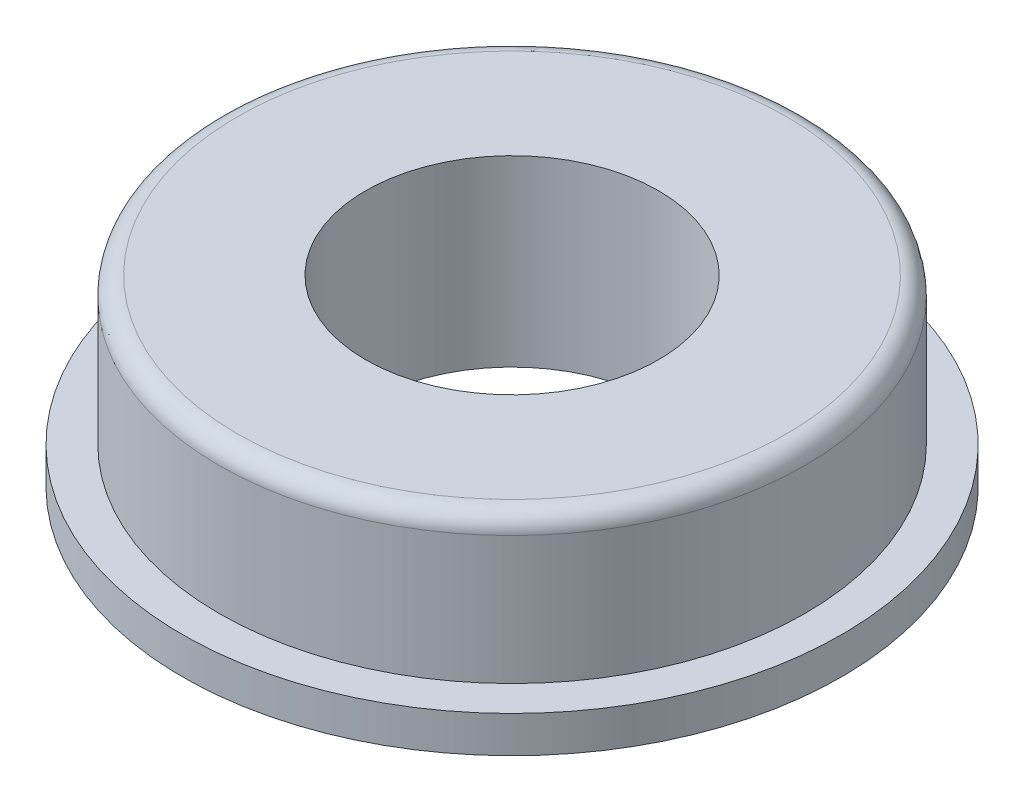
ISO-10303-21;
HEADER;
FILE_DESCRIPTION(('STEP AP214'),'2;1');
FILE_NAME('part.step','',(''),(''),'','','');
FILE_SCHEMA(('AUTOMOTIVE_DESIGN { 1 0 10303 214 1 1 1 1 }'));
ENDSEC;
DATA;
#1=APPLICATION_CONTEXT('core data for automotive mechanical design processes');
#2=APPLICATION_PROTOCOL_DEFINITION('international standard','automotive_design',2000,#1);
#3=PRODUCT_CONTEXT('',#1,'mechanical');
#4=PRODUCT('Part','Part','',(#3));
#5=PRODUCT_RELATED_PRODUCT_CATEGORY('part','',(#4));
#6=PRODUCT_DEFINITION_FORMATION('','',#4);
#7=PRODUCT_DEFINITION_CONTEXT('part definition',#1,'design');
#8=PRODUCT_DEFINITION('design','',#6,#7);
#9=PRODUCT_DEFINITION_SHAPE('','',#8);
#10=(LENGTH_UNIT() NAMED_UNIT(*) SI_UNIT(.MILLI.,.METRE.));
#11=(NAMED_UNIT(*) PLANE_ANGLE_UNIT() SI_UNIT($,.RADIAN.));
#12=(NAMED_UNIT(*) SI_UNIT($,.STERADIAN.) SOLID_ANGLE_UNIT());
#13=UNCERTAINTY_MEASURE_WITH_UNIT(LENGTH_MEASURE(1.E-05),#10,'distance_accuracy_value','');
#14=(GEOMETRIC_REPRESENTATION_CONTEXT(3) GLOBAL_UNCERTAINTY_ASSIGNED_CONTEXT((#13)) GLOBAL_UNIT_ASSIGNED_CONTEXT((#10,
#11,#12)) REPRESENTATION_CONTEXT('',''));
#15=CARTESIAN_POINT('',(0.,0.,0.));
#16=DIRECTION('',(0.,0.,1.));
#17=DIRECTION('',(1.,0.,0.));
#18=AXIS2_PLACEMENT_3D('',#15,#16,#17);
#19=CARTESIAN_POINT('',(0.,4.5,0.));
#20=DIRECTION('',(0.,1.,0.));
#21=DIRECTION('',(0.,0.,1.));
#22=AXIS2_PLACEMENT_3D('',#19,#20,#21);
#23=TOROIDAL_SURFACE('',#22,7.5,0.5);
#24=CARTESIAN_POINT('',(0.,4.5,0.));
#25=DIRECTION('',(0.,-1.,0.));
#26=DIRECTION('',(0.,0.,-1.));
#27=AXIS2_PLACEMENT_3D('',#24,#25,#26);
#28=CIRCLE('',#27,8.);
#29=CARTESIAN_POINT('',(0.,4.5,-8.));
#30=VERTEX_POINT('',#29);
#31=EDGE_CURVE('E45',#30,#30,#28,.T.);
#32=ORIENTED_EDGE('',*,*,#31,.F.);
#33=EDGE_LOOP('',(#32));
#34=FACE_BOUND('',#33,.T.);
#35=CARTESIAN_POINT('',(0.,5.,0.));
#36=DIRECTION('',(0.,-1.,0.));
#37=DIRECTION('',(0.,0.,1.));
#38=AXIS2_PLACEMENT_3D('',#35,#36,#37);
#39=CIRCLE('',#38,7.5);
#40=CARTESIAN_POINT('',(0.,5.,-7.5));
#41=VERTEX_POINT('',#40);
#42=CARTESIAN_POINT('',(0.,5.,7.5));
#43=VERTEX_POINT('',#42);
#44=EDGE_CURVE('E37',#41,#43,#39,.F.);
#45=ORIENTED_EDGE('',*,*,#44,.F.);
#46=CARTESIAN_POINT('',(0.,5.,0.));
#47=DIRECTION('',(0.,-1.,0.));
#48=DIRECTION('',(0.,0.,-1.));
#49=AXIS2_PLACEMENT_3D('',#46,#47,#48);
#50=CIRCLE('',#49,7.5);
#51=EDGE_CURVE('E34',#43,#41,#50,.F.);
#52=ORIENTED_EDGE('',*,*,#51,.F.);
#53=EDGE_LOOP('',(#45,#52));
#54=FACE_BOUND('',#53,.T.);
#55=ADVANCED_FACE('F16',(#34,#54),#23,.T.);
#56=CARTESIAN_POINT('',(0.,5.,0.));
#57=DIRECTION('',(0.,-1.,0.));
#58=DIRECTION('',(0.,0.,-1.));
#59=AXIS2_PLACEMENT_3D('',#56,#57,#58);
#60=CYLINDRICAL_SURFACE('',#59,8.);
#61=CARTESIAN_POINT('',(0.,1.,0.));
#62=DIRECTION('',(0.,-1.,0.));
#63=DIRECTION('',(0.,0.,-1.));
#64=AXIS2_PLACEMENT_3D('',#61,#62,#63);
#65=CIRCLE('',#64,8.);
#66=CARTESIAN_POINT('',(0.,1.,-8.));
#67=VERTEX_POINT('',#66);
#68=EDGE_CURVE('E42',#67,#67,#65,.F.);
#69=ORIENTED_EDGE('',*,*,#68,.T.);
#70=EDGE_LOOP('',(#69));
#71=FACE_BOUND('',#70,.T.);
#72=ORIENTED_EDGE('',*,*,#31,.T.);
#73=EDGE_LOOP('',(#72));
#74=FACE_BOUND('',#73,.T.);
#75=ADVANCED_FACE('F79',(#71,#74),#60,.T.);
#76=CARTESIAN_POINT('',(0.,5.,0.));
#77=DIRECTION('',(0.,1.,0.));
#78=DIRECTION('',(0.,0.,1.));
#79=AXIS2_PLACEMENT_3D('',#76,#77,#78);
#80=PLANE('',#79);
#81=CARTESIAN_POINT('',(0.,5.,0.));
#82=DIRECTION('',(0.,-1.,0.));
#83=DIRECTION('',(0.,0.,-1.));
#84=AXIS2_PLACEMENT_3D('',#81,#82,#83);
#85=CIRCLE('',#84,4.);
#86=CARTESIAN_POINT('',(0.,5.,-4.));
#87=VERTEX_POINT('',#86);
#88=EDGE_CURVE('E49',#87,#87,#85,.T.);
#89=ORIENTED_EDGE('',*,*,#88,.T.);
#90=EDGE_LOOP('',(#89));
#91=FACE_BOUND('',#90,.T.);
#92=ORIENTED_EDGE('',*,*,#51,.T.);
#93=ORIENTED_EDGE('',*,*,#44,.T.);
#94=EDGE_LOOP('',(#92,#93));
#95=FACE_BOUND('',#94,.T.);
#96=ADVANCED_FACE('F39',(#91,#95),#80,.T.);
#97=CARTESIAN_POINT('',(0.,1.,0.));
#98=DIRECTION('',(0.,-1.,0.));
#99=DIRECTION('',(0.,0.,-1.));
#100=AXIS2_PLACEMENT_3D('',#97,#98,#99);
#101=PLANE('',#100);
#102=ORIENTED_EDGE('',*,*,#68,.F.);
#103=EDGE_LOOP('',(#102));
#104=FACE_BOUND('',#103,.T.);
#105=CARTESIAN_POINT('',(0.,1.,0.));
#106=DIRECTION('',(0.,-1.,0.));
#107=DIRECTION('',(0.,0.,-1.));
#108=AXIS2_PLACEMENT_3D('',#105,#106,#107);
#109=CIRCLE('',#108,9.);
#110=CARTESIAN_POINT('',(0.,1.,-9.));
#111=VERTEX_POINT('',#110);
#112=EDGE_CURVE('E52',#111,#111,#109,.T.);
#113=ORIENTED_EDGE('',*,*,#112,.F.);
#114=EDGE_LOOP('',(#113));
#115=FACE_BOUND('',#114,.T.);
#116=ADVANCED_FACE('F78',(#104,#115),#101,.F.);
#117=CARTESIAN_POINT('',(0.,5.,0.));
#118=DIRECTION('',(0.,-1.,0.));
#119=DIRECTION('',(0.,0.,-1.));
#120=AXIS2_PLACEMENT_3D('',#117,#118,#119);
#121=CYLINDRICAL_SURFACE('',#120,4.);
#122=CARTESIAN_POINT('',(0.,0.,0.));
#123=DIRECTION('',(0.,-1.,0.));
#124=DIRECTION('',(0.,0.,-1.));
#125=AXIS2_PLACEMENT_3D('',#122,#123,#124);
#126=CIRCLE('',#125,4.);
#127=CARTESIAN_POINT('',(0.,0.,-4.));
#128=VERTEX_POINT('',#127);
#129=EDGE_CURVE('E27',#128,#128,#126,.T.);
#130=ORIENTED_EDGE('',*,*,#129,.T.);
#131=EDGE_LOOP('',(#130));
#132=FACE_BOUND('',#131,.T.);
#133=ORIENTED_EDGE('',*,*,#88,.F.);
#134=EDGE_LOOP('',(#133));
#135=FACE_BOUND('',#134,.T.);
#136=ADVANCED_FACE('F106',(#132,#135),#121,.F.);
#137=CARTESIAN_POINT('',(0.,1.,0.));
#138=DIRECTION('',(0.,-1.,0.));
#139=DIRECTION('',(0.,0.,-1.));
#140=AXIS2_PLACEMENT_3D('',#137,#138,#139);
#141=CYLINDRICAL_SURFACE('',#140,9.);
#142=CARTESIAN_POINT('',(0.,0.,0.));
#143=DIRECTION('',(0.,-1.,0.));
#144=DIRECTION('',(0.,0.,-1.));
#145=AXIS2_PLACEMENT_3D('',#142,#143,#144);
#146=CIRCLE('',#145,9.);
#147=CARTESIAN_POINT('',(0.,0.,-9.));
#148=VERTEX_POINT('',#147);
#149=EDGE_CURVE('E11',#148,#148,#146,.F.);
#150=ORIENTED_EDGE('',*,*,#149,.T.);
#151=EDGE_LOOP('',(#150));
#152=FACE_BOUND('',#151,.T.);
#153=ORIENTED_EDGE('',*,*,#112,.T.);
#154=EDGE_LOOP('',(#153));
#155=FACE_BOUND('',#154,.T.);
#156=ADVANCED_FACE('F100',(#152,#155),#141,.T.);
#157=CARTESIAN_POINT('',(0.,0.,0.));
#158=DIRECTION('',(0.,1.,0.));
#159=DIRECTION('',(0.,0.,1.));
#160=AXIS2_PLACEMENT_3D('',#157,#158,#159);
#161=PLANE('',#160);
#162=ORIENTED_EDGE('',*,*,#149,.F.);
#163=EDGE_LOOP('',(#162));
#164=FACE_BOUND('',#163,.T.);
#165=ORIENTED_EDGE('',*,*,#129,.F.);
#166=EDGE_LOOP('',(#165));
#167=FACE_BOUND('',#166,.T.);
#168=ADVANCED_FACE('F98',(#164,#167),#161,.F.);
#169=CLOSED_SHELL('',(#55,#75,#96,#116,#136,#156,#168));
#170=MANIFOLD_SOLID_BREP('B1',#169);
#171=ADVANCED_BREP_SHAPE_REPRESENTATION('',(#18,#170),#14);
#172=SHAPE_DEFINITION_REPRESENTATION(#9,#171);
ENDSEC;
END-ISO-10303-21;
